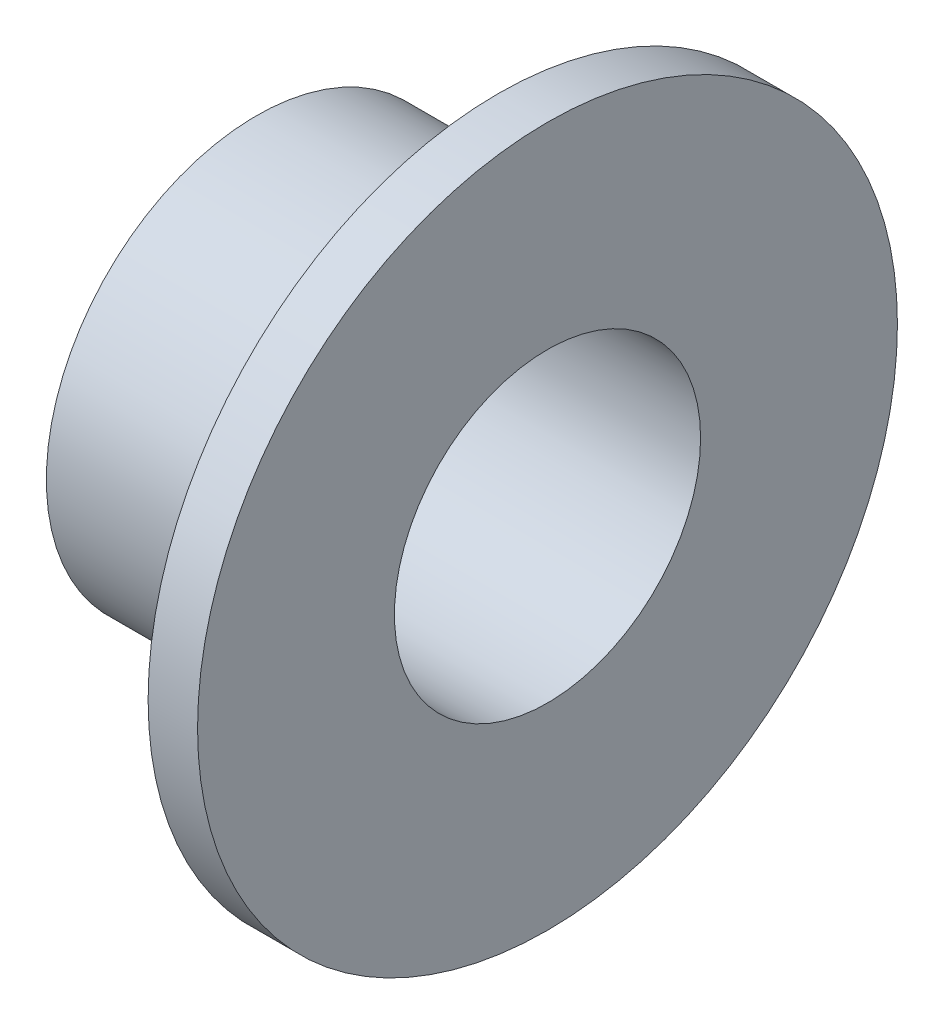
ISO-10303-21;
HEADER;
FILE_DESCRIPTION(('STEP AP214'),'2;1');
FILE_NAME('part.step','',(''),(''),'','','');
FILE_SCHEMA(('AUTOMOTIVE_DESIGN { 1 0 10303 214 1 1 1 1 }'));
ENDSEC;
DATA;
#1=APPLICATION_CONTEXT('core data for automotive mechanical design processes');
#2=APPLICATION_PROTOCOL_DEFINITION('international standard','automotive_design',2000,#1);
#3=PRODUCT_CONTEXT('',#1,'mechanical');
#4=PRODUCT('Part','Part','',(#3));
#5=PRODUCT_RELATED_PRODUCT_CATEGORY('part','',(#4));
#6=PRODUCT_DEFINITION_FORMATION('','',#4);
#7=PRODUCT_DEFINITION_CONTEXT('part definition',#1,'design');
#8=PRODUCT_DEFINITION('design','',#6,#7);
#9=PRODUCT_DEFINITION_SHAPE('','',#8);
#10=(LENGTH_UNIT() NAMED_UNIT(*) SI_UNIT(.MILLI.,.METRE.));
#11=(NAMED_UNIT(*) PLANE_ANGLE_UNIT() SI_UNIT($,.RADIAN.));
#12=(NAMED_UNIT(*) SI_UNIT($,.STERADIAN.) SOLID_ANGLE_UNIT());
#13=UNCERTAINTY_MEASURE_WITH_UNIT(LENGTH_MEASURE(1.E-05),#10,'distance_accuracy_value','');
#14=(GEOMETRIC_REPRESENTATION_CONTEXT(3) GLOBAL_UNCERTAINTY_ASSIGNED_CONTEXT((#13)) GLOBAL_UNIT_ASSIGNED_CONTEXT((#10,
#11,#12)) REPRESENTATION_CONTEXT('',''));
#15=CARTESIAN_POINT('',(0.,0.,0.));
#16=DIRECTION('',(0.,0.,1.));
#17=DIRECTION('',(1.,0.,0.));
#18=AXIS2_PLACEMENT_3D('',#15,#16,#17);
#19=CARTESIAN_POINT('',(0.,0.,0.));
#20=DIRECTION('',(1.,0.,0.));
#21=DIRECTION('',(0.,0.,-1.));
#22=AXIS2_PLACEMENT_3D('',#19,#20,#21);
#23=CYLINDRICAL_SURFACE('',#22,2.0447);
#24=CARTESIAN_POINT('',(0.,0.,0.));
#25=DIRECTION('',(1.,0.,0.));
#26=DIRECTION('',(0.,0.,-1.));
#27=AXIS2_PLACEMENT_3D('',#24,#25,#26);
#28=CIRCLE('',#27,2.0447);
#29=CARTESIAN_POINT('',(0.,0.,-2.0447));
#30=VERTEX_POINT('',#29);
#31=EDGE_CURVE('E10',#30,#30,#28,.T.);
#32=ORIENTED_EDGE('',*,*,#31,.T.);
#33=EDGE_LOOP('',(#32));
#34=FACE_BOUND('',#33,.T.);
#35=CARTESIAN_POINT('',(-3.8862,0.,0.));
#36=DIRECTION('',(1.,0.,0.));
#37=DIRECTION('',(0.,0.,-1.));
#38=AXIS2_PLACEMENT_3D('',#35,#36,#37);
#39=CIRCLE('',#38,2.0447);
#40=CARTESIAN_POINT('',(-3.8862,0.,-2.0447));
#41=VERTEX_POINT('',#40);
#42=EDGE_CURVE('E54',#41,#41,#39,.T.);
#43=ORIENTED_EDGE('',*,*,#42,.F.);
#44=EDGE_LOOP('',(#43));
#45=FACE_BOUND('',#44,.T.);
#46=ADVANCED_FACE('F32',(#34,#45),#23,.F.);
#47=CARTESIAN_POINT('',(0.,0.,-2.0447));
#48=DIRECTION('',(1.,0.,0.));
#49=DIRECTION('',(0.,0.,-1.));
#50=AXIS2_PLACEMENT_3D('',#47,#48,#49);
#51=PLANE('',#50);
#52=CARTESIAN_POINT('',(0.,0.,0.));
#53=DIRECTION('',(1.,0.,0.));
#54=DIRECTION('',(0.,0.,-1.));
#55=AXIS2_PLACEMENT_3D('',#52,#53,#54);
#56=CIRCLE('',#55,4.6736);
#57=CARTESIAN_POINT('',(0.,0.,-4.6736));
#58=VERTEX_POINT('',#57);
#59=EDGE_CURVE('E38',#58,#58,#56,.T.);
#60=ORIENTED_EDGE('',*,*,#59,.T.);
#61=EDGE_LOOP('',(#60));
#62=FACE_BOUND('',#61,.T.);
#63=ORIENTED_EDGE('',*,*,#31,.F.);
#64=EDGE_LOOP('',(#63));
#65=FACE_BOUND('',#64,.T.);
#66=ADVANCED_FACE('F62',(#62,#65),#51,.T.);
#67=CARTESIAN_POINT('',(0.,0.,0.));
#68=DIRECTION('',(1.,0.,0.));
#69=DIRECTION('',(0.,0.,-1.));
#70=AXIS2_PLACEMENT_3D('',#67,#68,#69);
#71=CYLINDRICAL_SURFACE('',#70,4.6736);
#72=CARTESIAN_POINT('',(-0.6604,0.,0.));
#73=DIRECTION('',(1.,0.,0.));
#74=DIRECTION('',(0.,0.,-1.));
#75=AXIS2_PLACEMENT_3D('',#72,#73,#74);
#76=CIRCLE('',#75,4.6736);
#77=CARTESIAN_POINT('',(-0.6604,0.,-4.6736));
#78=VERTEX_POINT('',#77);
#79=EDGE_CURVE('E42',#78,#78,#76,.T.);
#80=ORIENTED_EDGE('',*,*,#79,.T.);
#81=EDGE_LOOP('',(#80));
#82=FACE_BOUND('',#81,.T.);
#83=ORIENTED_EDGE('',*,*,#59,.F.);
#84=EDGE_LOOP('',(#83));
#85=FACE_BOUND('',#84,.T.);
#86=ADVANCED_FACE('F66',(#82,#85),#71,.T.);
#87=CARTESIAN_POINT('',(-0.6604,0.,-4.6736));
#88=DIRECTION('',(-1.,0.,0.));
#89=DIRECTION('',(0.,0.,1.));
#90=AXIS2_PLACEMENT_3D('',#87,#88,#89);
#91=PLANE('',#90);
#92=CARTESIAN_POINT('',(-0.6604,0.,0.));
#93=DIRECTION('',(1.,0.,0.));
#94=DIRECTION('',(0.,0.,-1.));
#95=AXIS2_PLACEMENT_3D('',#92,#93,#94);
#96=CIRCLE('',#95,2.8067);
#97=CARTESIAN_POINT('',(-0.6604,0.,-2.8067));
#98=VERTEX_POINT('',#97);
#99=EDGE_CURVE('E46',#98,#98,#96,.T.);
#100=ORIENTED_EDGE('',*,*,#99,.T.);
#101=EDGE_LOOP('',(#100));
#102=FACE_BOUND('',#101,.T.);
#103=ORIENTED_EDGE('',*,*,#79,.F.);
#104=EDGE_LOOP('',(#103));
#105=FACE_BOUND('',#104,.T.);
#106=ADVANCED_FACE('F70',(#102,#105),#91,.T.);
#107=CARTESIAN_POINT('',(0.,0.,0.));
#108=DIRECTION('',(1.,0.,0.));
#109=DIRECTION('',(0.,0.,-1.));
#110=AXIS2_PLACEMENT_3D('',#107,#108,#109);
#111=CYLINDRICAL_SURFACE('',#110,2.8067);
#112=CARTESIAN_POINT('',(-3.8862,0.,0.));
#113=DIRECTION('',(1.,0.,0.));
#114=DIRECTION('',(0.,0.,-1.));
#115=AXIS2_PLACEMENT_3D('',#112,#113,#114);
#116=CIRCLE('',#115,2.8067);
#117=CARTESIAN_POINT('',(-3.8862,0.,-2.8067));
#118=VERTEX_POINT('',#117);
#119=EDGE_CURVE('E51',#118,#118,#116,.T.);
#120=ORIENTED_EDGE('',*,*,#119,.T.);
#121=EDGE_LOOP('',(#120));
#122=FACE_BOUND('',#121,.T.);
#123=ORIENTED_EDGE('',*,*,#99,.F.);
#124=EDGE_LOOP('',(#123));
#125=FACE_BOUND('',#124,.T.);
#126=ADVANCED_FACE('F77',(#122,#125),#111,.T.);
#127=CARTESIAN_POINT('',(-3.8862,0.,-2.8067));
#128=DIRECTION('',(-1.,0.,0.));
#129=DIRECTION('',(0.,0.,1.));
#130=AXIS2_PLACEMENT_3D('',#127,#128,#129);
#131=PLANE('',#130);
#132=ORIENTED_EDGE('',*,*,#42,.T.);
#133=EDGE_LOOP('',(#132));
#134=FACE_BOUND('',#133,.T.);
#135=ORIENTED_EDGE('',*,*,#119,.F.);
#136=EDGE_LOOP('',(#135));
#137=FACE_BOUND('',#136,.T.);
#138=ADVANCED_FACE('F58',(#134,#137),#131,.T.);
#139=CLOSED_SHELL('',(#46,#66,#86,#106,#126,#138));
#140=MANIFOLD_SOLID_BREP('B2',#139);
#141=ADVANCED_BREP_SHAPE_REPRESENTATION('',(#18,#140),#14);
#142=SHAPE_DEFINITION_REPRESENTATION(#9,#141);
ENDSEC;
END-ISO-10303-21;
